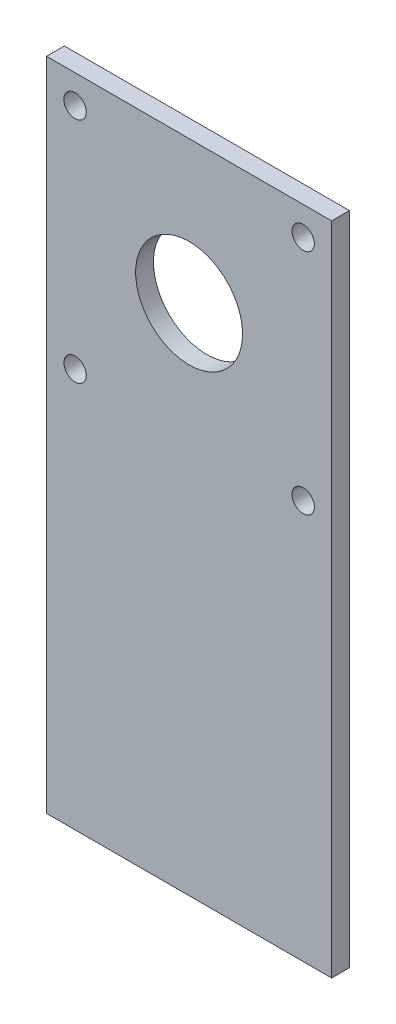
ISO-10303-21;
HEADER;
FILE_DESCRIPTION(('STEP AP214'),'2;1');
FILE_NAME('part.step','',(''),(''),'','','');
FILE_SCHEMA(('AUTOMOTIVE_DESIGN { 1 0 10303 214 1 1 1 1 }'));
ENDSEC;
DATA;
#1=APPLICATION_CONTEXT('core data for automotive mechanical design processes');
#2=APPLICATION_PROTOCOL_DEFINITION('international standard','automotive_design',2000,#1);
#3=PRODUCT_CONTEXT('',#1,'mechanical');
#4=PRODUCT('Part','Part','',(#3));
#5=PRODUCT_RELATED_PRODUCT_CATEGORY('part','',(#4));
#6=PRODUCT_DEFINITION_FORMATION('','',#4);
#7=PRODUCT_DEFINITION_CONTEXT('part definition',#1,'design');
#8=PRODUCT_DEFINITION('design','',#6,#7);
#9=PRODUCT_DEFINITION_SHAPE('','',#8);
#10=(LENGTH_UNIT() NAMED_UNIT(*) SI_UNIT(.MILLI.,.METRE.));
#11=(NAMED_UNIT(*) PLANE_ANGLE_UNIT() SI_UNIT($,.RADIAN.));
#12=(NAMED_UNIT(*) SI_UNIT($,.STERADIAN.) SOLID_ANGLE_UNIT());
#13=UNCERTAINTY_MEASURE_WITH_UNIT(LENGTH_MEASURE(1.E-05),#10,'distance_accuracy_value','');
#14=(GEOMETRIC_REPRESENTATION_CONTEXT(3) GLOBAL_UNCERTAINTY_ASSIGNED_CONTEXT((#13)) GLOBAL_UNIT_ASSIGNED_CONTEXT((#10,
#11,#12)) REPRESENTATION_CONTEXT('',''));
#15=CARTESIAN_POINT('',(0.,0.,0.));
#16=DIRECTION('',(0.,0.,1.));
#17=DIRECTION('',(1.,0.,0.));
#18=AXIS2_PLACEMENT_3D('',#15,#16,#17);
#19=CARTESIAN_POINT('',(0.,50.8,3.175));
#20=DIRECTION('',(0.,0.,-1.));
#21=DIRECTION('',(-1.,0.,0.));
#22=AXIS2_PLACEMENT_3D('',#19,#20,#21);
#23=PLANE('',#22);
#24=CARTESIAN_POINT('',(5.08,5.08,3.175));
#25=DIRECTION('',(0.,0.,1.));
#26=DIRECTION('',(1.,0.,0.));
#27=AXIS2_PLACEMENT_3D('',#24,#25,#26);
#28=CIRCLE('',#27,2.);
#29=CARTESIAN_POINT('',(7.08,5.08,3.175));
#30=VERTEX_POINT('',#29);
#31=EDGE_CURVE('E106',#30,#30,#28,.T.);
#32=ORIENTED_EDGE('',*,*,#31,.F.);
#33=EDGE_LOOP('',(#32));
#34=FACE_BOUND('',#33,.T.);
#35=CARTESIAN_POINT('',(45.72,45.72,3.175));
#36=DIRECTION('',(0.,0.,1.));
#37=DIRECTION('',(1.,0.,0.));
#38=AXIS2_PLACEMENT_3D('',#35,#36,#37);
#39=CIRCLE('',#38,2.);
#40=CARTESIAN_POINT('',(47.72,45.72,3.175));
#41=VERTEX_POINT('',#40);
#42=EDGE_CURVE('E118',#41,#41,#39,.T.);
#43=ORIENTED_EDGE('',*,*,#42,.F.);
#44=EDGE_LOOP('',(#43));
#45=FACE_BOUND('',#44,.T.);
#46=DIRECTION('',(0.,-1.,0.));
#47=VECTOR('',#46,1.);
#48=CARTESIAN_POINT('',(0.,0.,3.175));
#49=LINE('',#48,#47);
#50=CARTESIAN_POINT('',(0.,50.8,3.175));
#51=VERTEX_POINT('',#50);
#52=CARTESIAN_POINT('',(0.,-66.04,3.175));
#53=VERTEX_POINT('',#52);
#54=EDGE_CURVE('E64',#51,#53,#49,.T.);
#55=ORIENTED_EDGE('',*,*,#54,.T.);
#56=DIRECTION('',(-1.,0.,0.));
#57=VECTOR('',#56,1.);
#58=CARTESIAN_POINT('',(0.,-66.04,3.175));
#59=LINE('',#58,#57);
#60=CARTESIAN_POINT('',(50.8,-66.04,3.175));
#61=VERTEX_POINT('',#60);
#62=EDGE_CURVE('E94',#61,#53,#59,.T.);
#63=ORIENTED_EDGE('',*,*,#62,.F.);
#64=DIRECTION('',(0.,1.,0.));
#65=VECTOR('',#64,1.);
#66=CARTESIAN_POINT('',(50.8,0.,3.175));
#67=LINE('',#66,#65);
#68=CARTESIAN_POINT('',(50.8,50.8,3.175));
#69=VERTEX_POINT('',#68);
#70=EDGE_CURVE('E129',#61,#69,#67,.T.);
#71=ORIENTED_EDGE('',*,*,#70,.T.);
#72=DIRECTION('',(-1.,0.,0.));
#73=VECTOR('',#72,1.);
#74=CARTESIAN_POINT('',(0.,50.8,3.175));
#75=LINE('',#74,#73);
#76=EDGE_CURVE('E48',#69,#51,#75,.T.);
#77=ORIENTED_EDGE('',*,*,#76,.T.);
#78=EDGE_LOOP('',(#55,#63,#71,#77));
#79=FACE_BOUND('',#78,.T.);
#80=CARTESIAN_POINT('',(5.08,45.72,3.175));
#81=DIRECTION('',(0.,0.,1.));
#82=DIRECTION('',(1.,0.,0.));
#83=AXIS2_PLACEMENT_3D('',#80,#81,#82);
#84=CIRCLE('',#83,2.);
#85=CARTESIAN_POINT('',(7.08,45.72,3.175));
#86=VERTEX_POINT('',#85);
#87=EDGE_CURVE('E83',#86,#86,#84,.T.);
#88=ORIENTED_EDGE('',*,*,#87,.F.);
#89=EDGE_LOOP('',(#88));
#90=FACE_BOUND('',#89,.T.);
#91=CARTESIAN_POINT('',(45.72,5.08,3.175));
#92=DIRECTION('',(0.,0.,1.));
#93=DIRECTION('',(1.,0.,0.));
#94=AXIS2_PLACEMENT_3D('',#91,#92,#93);
#95=CIRCLE('',#94,2.);
#96=CARTESIAN_POINT('',(47.72,5.08,3.175));
#97=VERTEX_POINT('',#96);
#98=EDGE_CURVE('E112',#97,#97,#95,.T.);
#99=ORIENTED_EDGE('',*,*,#98,.F.);
#100=EDGE_LOOP('',(#99));
#101=FACE_BOUND('',#100,.T.);
#102=CARTESIAN_POINT('',(25.4,25.4,3.175));
#103=DIRECTION('',(0.,0.,1.));
#104=DIRECTION('',(1.,0.,0.));
#105=AXIS2_PLACEMENT_3D('',#102,#103,#104);
#106=CIRCLE('',#105,9.525);
#107=CARTESIAN_POINT('',(34.925,25.4,3.175));
#108=VERTEX_POINT('',#107);
#109=EDGE_CURVE('E100',#108,#108,#106,.T.);
#110=ORIENTED_EDGE('',*,*,#109,.F.);
#111=EDGE_LOOP('',(#110));
#112=FACE_BOUND('',#111,.T.);
#113=ADVANCED_FACE('F31',(#34,#45,#79,#90,#101,#112),#23,.F.);
#114=CARTESIAN_POINT('',(0.,50.8,0.));
#115=DIRECTION('',(0.,0.,-1.));
#116=DIRECTION('',(-1.,0.,0.));
#117=AXIS2_PLACEMENT_3D('',#114,#115,#116);
#118=PLANE('',#117);
#119=CARTESIAN_POINT('',(5.08,5.08,0.));
#120=DIRECTION('',(0.,0.,1.));
#121=DIRECTION('',(1.,0.,0.));
#122=AXIS2_PLACEMENT_3D('',#119,#120,#121);
#123=CIRCLE('',#122,2.);
#124=CARTESIAN_POINT('',(7.08,5.08,0.));
#125=VERTEX_POINT('',#124);
#126=EDGE_CURVE('E103',#125,#125,#123,.T.);
#127=ORIENTED_EDGE('',*,*,#126,.T.);
#128=EDGE_LOOP('',(#127));
#129=FACE_BOUND('',#128,.T.);
#130=CARTESIAN_POINT('',(45.72,45.72,0.));
#131=DIRECTION('',(0.,0.,1.));
#132=DIRECTION('',(1.,0.,0.));
#133=AXIS2_PLACEMENT_3D('',#130,#131,#132);
#134=CIRCLE('',#133,2.);
#135=CARTESIAN_POINT('',(47.72,45.72,0.));
#136=VERTEX_POINT('',#135);
#137=EDGE_CURVE('E115',#136,#136,#134,.T.);
#138=ORIENTED_EDGE('',*,*,#137,.T.);
#139=EDGE_LOOP('',(#138));
#140=FACE_BOUND('',#139,.T.);
#141=DIRECTION('',(0.,-1.,0.));
#142=VECTOR('',#141,1.);
#143=CARTESIAN_POINT('',(0.,0.,0.));
#144=LINE('',#143,#142);
#145=CARTESIAN_POINT('',(0.,50.8,0.));
#146=VERTEX_POINT('',#145);
#147=CARTESIAN_POINT('',(0.,-66.04,0.));
#148=VERTEX_POINT('',#147);
#149=EDGE_CURVE('E77',#146,#148,#144,.T.);
#150=ORIENTED_EDGE('',*,*,#149,.F.);
#151=DIRECTION('',(-1.,0.,0.));
#152=VECTOR('',#151,1.);
#153=CARTESIAN_POINT('',(0.,50.8,0.));
#154=LINE('',#153,#152);
#155=CARTESIAN_POINT('',(50.8,50.8,0.));
#156=VERTEX_POINT('',#155);
#157=EDGE_CURVE('E130',#156,#146,#154,.T.);
#158=ORIENTED_EDGE('',*,*,#157,.F.);
#159=DIRECTION('',(0.,1.,0.));
#160=VECTOR('',#159,1.);
#161=CARTESIAN_POINT('',(50.8,0.,0.));
#162=LINE('',#161,#160);
#163=CARTESIAN_POINT('',(50.8,-66.04,0.));
#164=VERTEX_POINT('',#163);
#165=EDGE_CURVE('E59',#164,#156,#162,.T.);
#166=ORIENTED_EDGE('',*,*,#165,.F.);
#167=DIRECTION('',(1.,0.,0.));
#168=VECTOR('',#167,1.);
#169=CARTESIAN_POINT('',(0.,-66.04,0.));
#170=LINE('',#169,#168);
#171=EDGE_CURVE('E86',#148,#164,#170,.T.);
#172=ORIENTED_EDGE('',*,*,#171,.F.);
#173=EDGE_LOOP('',(#150,#158,#166,#172));
#174=FACE_BOUND('',#173,.T.);
#175=CARTESIAN_POINT('',(5.08,45.72,0.));
#176=DIRECTION('',(0.,0.,1.));
#177=DIRECTION('',(1.,0.,0.));
#178=AXIS2_PLACEMENT_3D('',#175,#176,#177);
#179=CIRCLE('',#178,2.);
#180=CARTESIAN_POINT('',(7.08,45.72,0.));
#181=VERTEX_POINT('',#180);
#182=EDGE_CURVE('E121',#181,#181,#179,.T.);
#183=ORIENTED_EDGE('',*,*,#182,.T.);
#184=EDGE_LOOP('',(#183));
#185=FACE_BOUND('',#184,.T.);
#186=CARTESIAN_POINT('',(45.72,5.08,0.));
#187=DIRECTION('',(0.,0.,1.));
#188=DIRECTION('',(1.,0.,0.));
#189=AXIS2_PLACEMENT_3D('',#186,#187,#188);
#190=CIRCLE('',#189,2.);
#191=CARTESIAN_POINT('',(47.72,5.08,0.));
#192=VERTEX_POINT('',#191);
#193=EDGE_CURVE('E109',#192,#192,#190,.T.);
#194=ORIENTED_EDGE('',*,*,#193,.T.);
#195=EDGE_LOOP('',(#194));
#196=FACE_BOUND('',#195,.T.);
#197=CARTESIAN_POINT('',(25.4,25.4,0.));
#198=DIRECTION('',(0.,0.,1.));
#199=DIRECTION('',(1.,0.,0.));
#200=AXIS2_PLACEMENT_3D('',#197,#198,#199);
#201=CIRCLE('',#200,9.525);
#202=CARTESIAN_POINT('',(34.925,25.4,0.));
#203=VERTEX_POINT('',#202);
#204=EDGE_CURVE('E99',#203,#203,#201,.T.);
#205=ORIENTED_EDGE('',*,*,#204,.T.);
#206=EDGE_LOOP('',(#205));
#207=FACE_BOUND('',#206,.T.);
#208=ADVANCED_FACE('F87',(#129,#140,#174,#185,#196,#207),#118,.T.);
#209=CARTESIAN_POINT('',(0.,0.,3.175));
#210=DIRECTION('',(1.,0.,0.));
#211=DIRECTION('',(0.,1.,0.));
#212=AXIS2_PLACEMENT_3D('',#209,#210,#211);
#213=PLANE('',#212);
#214=ORIENTED_EDGE('',*,*,#149,.T.);
#215=DIRECTION('',(0.,0.,-1.));
#216=VECTOR('',#215,1.);
#217=CARTESIAN_POINT('',(0.,-66.04,3.175));
#218=LINE('',#217,#216);
#219=EDGE_CURVE('E80',#53,#148,#218,.T.);
#220=ORIENTED_EDGE('',*,*,#219,.F.);
#221=ORIENTED_EDGE('',*,*,#54,.F.);
#222=DIRECTION('',(0.,0.,-1.));
#223=VECTOR('',#222,1.);
#224=CARTESIAN_POINT('',(0.,50.8,3.175));
#225=LINE('',#224,#223);
#226=EDGE_CURVE('E40',#51,#146,#225,.T.);
#227=ORIENTED_EDGE('',*,*,#226,.T.);
#228=EDGE_LOOP('',(#214,#220,#221,#227));
#229=FACE_BOUND('',#228,.T.);
#230=ADVANCED_FACE('F33',(#229),#213,.F.);
#231=CARTESIAN_POINT('',(50.8,0.,3.175));
#232=DIRECTION('',(-1.,0.,0.));
#233=DIRECTION('',(0.,-1.,0.));
#234=AXIS2_PLACEMENT_3D('',#231,#232,#233);
#235=PLANE('',#234);
#236=ORIENTED_EDGE('',*,*,#165,.T.);
#237=DIRECTION('',(0.,0.,-1.));
#238=VECTOR('',#237,1.);
#239=CARTESIAN_POINT('',(50.8,50.8,3.175));
#240=LINE('',#239,#238);
#241=EDGE_CURVE('E11',#69,#156,#240,.T.);
#242=ORIENTED_EDGE('',*,*,#241,.F.);
#243=ORIENTED_EDGE('',*,*,#70,.F.);
#244=DIRECTION('',(0.,0.,1.));
#245=VECTOR('',#244,1.);
#246=CARTESIAN_POINT('',(50.8,-66.04,3.175));
#247=LINE('',#246,#245);
#248=EDGE_CURVE('E91',#164,#61,#247,.T.);
#249=ORIENTED_EDGE('',*,*,#248,.F.);
#250=EDGE_LOOP('',(#236,#242,#243,#249));
#251=FACE_BOUND('',#250,.T.);
#252=ADVANCED_FACE('F136',(#251),#235,.F.);
#253=CARTESIAN_POINT('',(0.,50.8,3.175));
#254=DIRECTION('',(0.,-1.,0.));
#255=DIRECTION('',(0.,0.,-1.));
#256=AXIS2_PLACEMENT_3D('',#253,#254,#255);
#257=PLANE('',#256);
#258=ORIENTED_EDGE('',*,*,#157,.T.);
#259=ORIENTED_EDGE('',*,*,#226,.F.);
#260=ORIENTED_EDGE('',*,*,#76,.F.);
#261=ORIENTED_EDGE('',*,*,#241,.T.);
#262=EDGE_LOOP('',(#258,#259,#260,#261));
#263=FACE_BOUND('',#262,.T.);
#264=ADVANCED_FACE('F135',(#263),#257,.F.);
#265=CARTESIAN_POINT('',(5.08,45.72,3.175));
#266=DIRECTION('',(0.,0.,-1.));
#267=DIRECTION('',(-1.,0.,0.));
#268=AXIS2_PLACEMENT_3D('',#265,#266,#267);
#269=CYLINDRICAL_SURFACE('',#268,2.);
#270=ORIENTED_EDGE('',*,*,#87,.T.);
#271=EDGE_LOOP('',(#270));
#272=FACE_BOUND('',#271,.T.);
#273=ORIENTED_EDGE('',*,*,#182,.F.);
#274=EDGE_LOOP('',(#273));
#275=FACE_BOUND('',#274,.T.);
#276=ADVANCED_FACE('F164',(#272,#275),#269,.F.);
#277=CARTESIAN_POINT('',(45.72,45.72,3.175));
#278=DIRECTION('',(0.,0.,-1.));
#279=DIRECTION('',(-1.,0.,0.));
#280=AXIS2_PLACEMENT_3D('',#277,#278,#279);
#281=CYLINDRICAL_SURFACE('',#280,2.);
#282=ORIENTED_EDGE('',*,*,#42,.T.);
#283=EDGE_LOOP('',(#282));
#284=FACE_BOUND('',#283,.T.);
#285=ORIENTED_EDGE('',*,*,#137,.F.);
#286=EDGE_LOOP('',(#285));
#287=FACE_BOUND('',#286,.T.);
#288=ADVANCED_FACE('F181',(#284,#287),#281,.F.);
#289=CARTESIAN_POINT('',(45.72,5.08,3.175));
#290=DIRECTION('',(0.,0.,-1.));
#291=DIRECTION('',(-1.,0.,0.));
#292=AXIS2_PLACEMENT_3D('',#289,#290,#291);
#293=CYLINDRICAL_SURFACE('',#292,2.);
#294=ORIENTED_EDGE('',*,*,#98,.T.);
#295=EDGE_LOOP('',(#294));
#296=FACE_BOUND('',#295,.T.);
#297=ORIENTED_EDGE('',*,*,#193,.F.);
#298=EDGE_LOOP('',(#297));
#299=FACE_BOUND('',#298,.T.);
#300=ADVANCED_FACE('F188',(#296,#299),#293,.F.);
#301=CARTESIAN_POINT('',(5.08,5.08,3.175));
#302=DIRECTION('',(0.,0.,-1.));
#303=DIRECTION('',(-1.,0.,0.));
#304=AXIS2_PLACEMENT_3D('',#301,#302,#303);
#305=CYLINDRICAL_SURFACE('',#304,2.);
#306=ORIENTED_EDGE('',*,*,#31,.T.);
#307=EDGE_LOOP('',(#306));
#308=FACE_BOUND('',#307,.T.);
#309=ORIENTED_EDGE('',*,*,#126,.F.);
#310=EDGE_LOOP('',(#309));
#311=FACE_BOUND('',#310,.T.);
#312=ADVANCED_FACE('F150',(#308,#311),#305,.F.);
#313=CARTESIAN_POINT('',(25.4,25.4,3.175));
#314=DIRECTION('',(0.,0.,-1.));
#315=DIRECTION('',(-1.,0.,0.));
#316=AXIS2_PLACEMENT_3D('',#313,#314,#315);
#317=CYLINDRICAL_SURFACE('',#316,9.525);
#318=ORIENTED_EDGE('',*,*,#109,.T.);
#319=EDGE_LOOP('',(#318));
#320=FACE_BOUND('',#319,.T.);
#321=ORIENTED_EDGE('',*,*,#204,.F.);
#322=EDGE_LOOP('',(#321));
#323=FACE_BOUND('',#322,.T.);
#324=ADVANCED_FACE('F147',(#320,#323),#317,.F.);
#325=CARTESIAN_POINT('',(0.,-66.04,0.));
#326=DIRECTION('',(0.,-1.,0.));
#327=DIRECTION('',(0.,0.,-1.));
#328=AXIS2_PLACEMENT_3D('',#325,#326,#327);
#329=PLANE('',#328);
#330=ORIENTED_EDGE('',*,*,#219,.T.);
#331=ORIENTED_EDGE('',*,*,#171,.T.);
#332=ORIENTED_EDGE('',*,*,#248,.T.);
#333=ORIENTED_EDGE('',*,*,#62,.T.);
#334=EDGE_LOOP('',(#330,#331,#332,#333));
#335=FACE_BOUND('',#334,.T.);
#336=ADVANCED_FACE('F93',(#335),#329,.T.);
#337=CLOSED_SHELL('',(#113,#208,#230,#252,#264,#276,#288,#300,#312,#324,#336));
#338=MANIFOLD_SOLID_BREP('B2',#337);
#339=ADVANCED_BREP_SHAPE_REPRESENTATION('',(#18,#338),#14);
#340=SHAPE_DEFINITION_REPRESENTATION(#9,#339);
ENDSEC;
END-ISO-10303-21;
